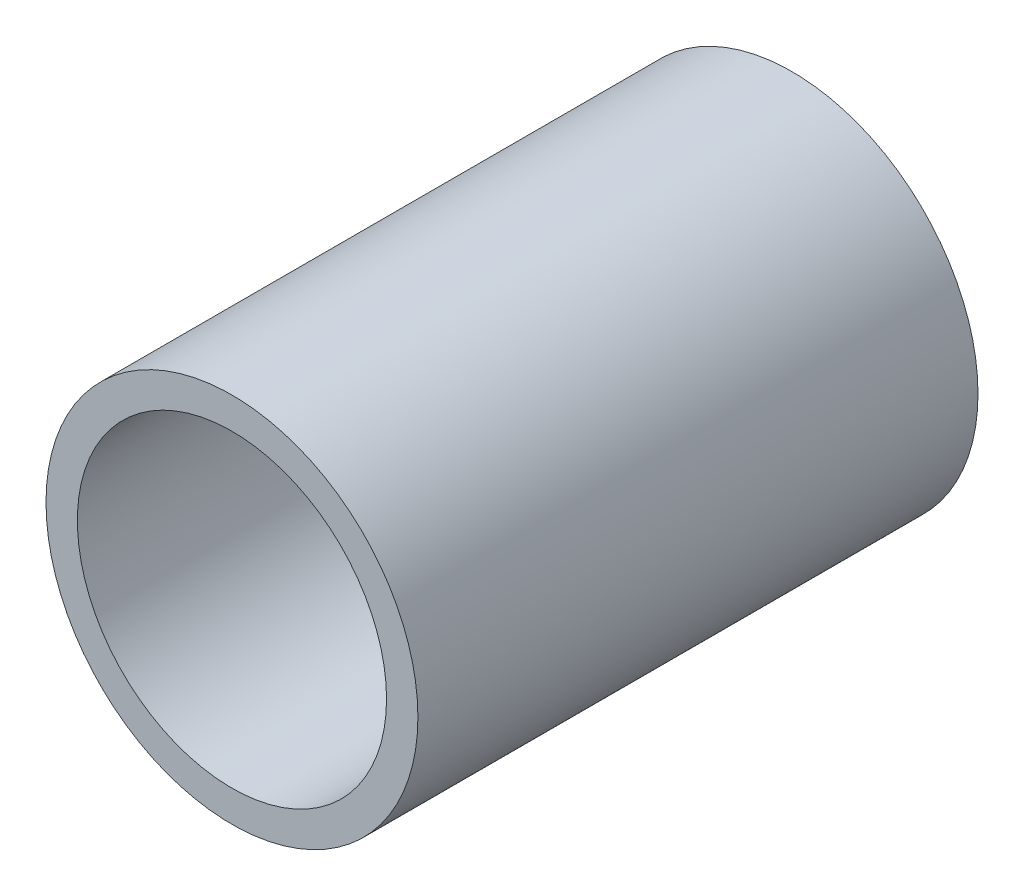
ISO-10303-21;
HEADER;
FILE_DESCRIPTION(('STEP AP214'),'2;1');
FILE_NAME('part.step','',(''),(''),'','','');
FILE_SCHEMA(('AUTOMOTIVE_DESIGN { 1 0 10303 214 1 1 1 1 }'));
ENDSEC;
DATA;
#1=APPLICATION_CONTEXT('core data for automotive mechanical design processes');
#2=APPLICATION_PROTOCOL_DEFINITION('international standard','automotive_design',2000,#1);
#3=PRODUCT_CONTEXT('',#1,'mechanical');
#4=PRODUCT('Part','Part','',(#3));
#5=PRODUCT_RELATED_PRODUCT_CATEGORY('part','',(#4));
#6=PRODUCT_DEFINITION_FORMATION('','',#4);
#7=PRODUCT_DEFINITION_CONTEXT('part definition',#1,'design');
#8=PRODUCT_DEFINITION('design','',#6,#7);
#9=PRODUCT_DEFINITION_SHAPE('','',#8);
#10=(LENGTH_UNIT() NAMED_UNIT(*) SI_UNIT(.MILLI.,.METRE.));
#11=(NAMED_UNIT(*) PLANE_ANGLE_UNIT() SI_UNIT($,.RADIAN.));
#12=(NAMED_UNIT(*) SI_UNIT($,.STERADIAN.) SOLID_ANGLE_UNIT());
#13=UNCERTAINTY_MEASURE_WITH_UNIT(LENGTH_MEASURE(1.E-05),#10,'distance_accuracy_value','');
#14=(GEOMETRIC_REPRESENTATION_CONTEXT(3) GLOBAL_UNCERTAINTY_ASSIGNED_CONTEXT((#13)) GLOBAL_UNIT_ASSIGNED_CONTEXT((#10,
#11,#12)) REPRESENTATION_CONTEXT('',''));
#15=CARTESIAN_POINT('',(0.,0.,0.));
#16=DIRECTION('',(0.,0.,1.));
#17=DIRECTION('',(1.,0.,0.));
#18=AXIS2_PLACEMENT_3D('',#15,#16,#17);
#19=CARTESIAN_POINT('',(0.,0.,63.5));
#20=DIRECTION('',(0.,0.,1.));
#21=DIRECTION('',(1.,0.,0.));
#22=AXIS2_PLACEMENT_3D('',#19,#20,#21);
#23=PLANE('',#22);
#24=CARTESIAN_POINT('',(0.,0.,63.5));
#25=DIRECTION('',(0.,0.,1.));
#26=DIRECTION('',(1.,0.,0.));
#27=AXIS2_PLACEMENT_3D('',#24,#25,#26);
#28=CIRCLE('',#27,21.082);
#29=CARTESIAN_POINT('',(21.0820000000001,0.,63.5));
#30=VERTEX_POINT('',#29);
#31=EDGE_CURVE('E12',#30,#30,#28,.T.);
#32=ORIENTED_EDGE('',*,*,#31,.T.);
#33=EDGE_LOOP('',(#32));
#34=FACE_BOUND('',#33,.T.);
#35=CARTESIAN_POINT('',(0.,0.,63.5));
#36=DIRECTION('',(0.,0.,1.));
#37=DIRECTION('',(1.,0.,0.));
#38=AXIS2_PLACEMENT_3D('',#35,#36,#37);
#39=CIRCLE('',#38,17.526);
#40=CARTESIAN_POINT('',(17.5260000000001,0.,63.5));
#41=VERTEX_POINT('',#40);
#42=EDGE_CURVE('E51',#41,#41,#39,.T.);
#43=ORIENTED_EDGE('',*,*,#42,.F.);
#44=EDGE_LOOP('',(#43));
#45=FACE_BOUND('',#44,.T.);
#46=ADVANCED_FACE('F40',(#34,#45),#23,.T.);
#47=CARTESIAN_POINT('',(0.,0.,0.));
#48=DIRECTION('',(0.,0.,1.));
#49=DIRECTION('',(1.,0.,0.));
#50=AXIS2_PLACEMENT_3D('',#47,#48,#49);
#51=PLANE('',#50);
#52=CARTESIAN_POINT('',(0.,0.,0.));
#53=DIRECTION('',(0.,0.,1.));
#54=DIRECTION('',(1.,0.,0.));
#55=AXIS2_PLACEMENT_3D('',#52,#53,#54);
#56=CIRCLE('',#55,21.082);
#57=CARTESIAN_POINT('',(21.0820000000001,0.,0.));
#58=VERTEX_POINT('',#57);
#59=EDGE_CURVE('E44',#58,#58,#56,.T.);
#60=ORIENTED_EDGE('',*,*,#59,.F.);
#61=EDGE_LOOP('',(#60));
#62=FACE_BOUND('',#61,.T.);
#63=CARTESIAN_POINT('',(0.,0.,0.));
#64=DIRECTION('',(0.,0.,1.));
#65=DIRECTION('',(1.,0.,0.));
#66=AXIS2_PLACEMENT_3D('',#63,#64,#65);
#67=CIRCLE('',#66,17.526);
#68=CARTESIAN_POINT('',(17.5260000000001,0.,0.));
#69=VERTEX_POINT('',#68);
#70=EDGE_CURVE('E53',#69,#69,#67,.T.);
#71=ORIENTED_EDGE('',*,*,#70,.T.);
#72=EDGE_LOOP('',(#71));
#73=FACE_BOUND('',#72,.T.);
#74=ADVANCED_FACE('F63',(#62,#73),#51,.F.);
#75=CARTESIAN_POINT('',(0.,0.,63.5));
#76=DIRECTION('',(0.,0.,-1.));
#77=DIRECTION('',(-1.,0.,0.));
#78=AXIS2_PLACEMENT_3D('',#75,#76,#77);
#79=CYLINDRICAL_SURFACE('',#78,21.082);
#80=ORIENTED_EDGE('',*,*,#31,.F.);
#81=EDGE_LOOP('',(#80));
#82=FACE_BOUND('',#81,.T.);
#83=ORIENTED_EDGE('',*,*,#59,.T.);
#84=EDGE_LOOP('',(#83));
#85=FACE_BOUND('',#84,.T.);
#86=ADVANCED_FACE('F42',(#82,#85),#79,.T.);
#87=CARTESIAN_POINT('',(0.,0.,63.5));
#88=DIRECTION('',(0.,0.,-1.));
#89=DIRECTION('',(-1.,0.,0.));
#90=AXIS2_PLACEMENT_3D('',#87,#88,#89);
#91=CYLINDRICAL_SURFACE('',#90,17.526);
#92=ORIENTED_EDGE('',*,*,#42,.T.);
#93=EDGE_LOOP('',(#92));
#94=FACE_BOUND('',#93,.T.);
#95=ORIENTED_EDGE('',*,*,#70,.F.);
#96=EDGE_LOOP('',(#95));
#97=FACE_BOUND('',#96,.T.);
#98=ADVANCED_FACE('F59',(#94,#97),#91,.F.);
#99=CLOSED_SHELL('',(#46,#74,#86,#98));
#100=MANIFOLD_SOLID_BREP('B2',#99);
#101=ADVANCED_BREP_SHAPE_REPRESENTATION('',(#18,#100),#14);
#102=SHAPE_DEFINITION_REPRESENTATION(#9,#101);
ENDSEC;
END-ISO-10303-21;
